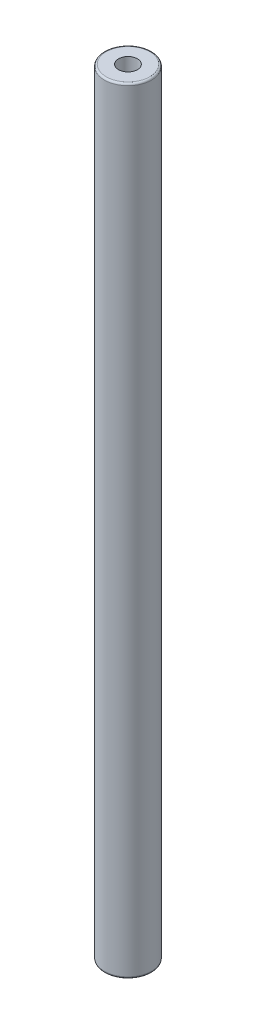
ISO-10303-21;
HEADER;
FILE_DESCRIPTION(('STEP AP214'),'2;1');
FILE_NAME('part.step','',(''),(''),'','','');
FILE_SCHEMA(('AUTOMOTIVE_DESIGN { 1 0 10303 214 1 1 1 1 }'));
ENDSEC;
DATA;
#1=APPLICATION_CONTEXT('core data for automotive mechanical design processes');
#2=APPLICATION_PROTOCOL_DEFINITION('international standard','automotive_design',2000,#1);
#3=PRODUCT_CONTEXT('',#1,'mechanical');
#4=PRODUCT('Part','Part','',(#3));
#5=PRODUCT_RELATED_PRODUCT_CATEGORY('part','',(#4));
#6=PRODUCT_DEFINITION_FORMATION('','',#4);
#7=PRODUCT_DEFINITION_CONTEXT('part definition',#1,'design');
#8=PRODUCT_DEFINITION('design','',#6,#7);
#9=PRODUCT_DEFINITION_SHAPE('','',#8);
#10=(LENGTH_UNIT() NAMED_UNIT(*) SI_UNIT(.MILLI.,.METRE.));
#11=(NAMED_UNIT(*) PLANE_ANGLE_UNIT() SI_UNIT($,.RADIAN.));
#12=(NAMED_UNIT(*) SI_UNIT($,.STERADIAN.) SOLID_ANGLE_UNIT());
#13=UNCERTAINTY_MEASURE_WITH_UNIT(LENGTH_MEASURE(1.E-05),#10,'distance_accuracy_value','');
#14=(GEOMETRIC_REPRESENTATION_CONTEXT(3) GLOBAL_UNCERTAINTY_ASSIGNED_CONTEXT((#13)) GLOBAL_UNIT_ASSIGNED_CONTEXT((#10,
#11,#12)) REPRESENTATION_CONTEXT('',''));
#15=CARTESIAN_POINT('',(0.,0.,0.));
#16=DIRECTION('',(0.,0.,1.));
#17=DIRECTION('',(1.,0.,0.));
#18=AXIS2_PLACEMENT_3D('',#15,#16,#17);
#19=CARTESIAN_POINT('',(0.,-41.,-2.49999999999998));
#20=DIRECTION('',(0.,1.,0.));
#21=DIRECTION('',(0.,0.,1.));
#22=AXIS2_PLACEMENT_3D('',#19,#20,#21);
#23=PLANE('',#22);
#24=CARTESIAN_POINT('',(0.,-41.,0.));
#25=DIRECTION('',(0.,1.,0.));
#26=DIRECTION('',(0.,0.,1.));
#27=AXIS2_PLACEMENT_3D('',#24,#25,#26);
#28=CIRCLE('',#27,2.29999999999998);
#29=CARTESIAN_POINT('',(0.,-41.,2.29999999999998));
#30=VERTEX_POINT('',#29);
#31=EDGE_CURVE('E45',#30,#30,#28,.F.);
#32=ORIENTED_EDGE('',*,*,#31,.T.);
#33=EDGE_LOOP('',(#32));
#34=FACE_BOUND('',#33,.T.);
#35=CARTESIAN_POINT('',(0.,-41.,0.));
#36=DIRECTION('',(0.,1.,0.));
#37=DIRECTION('',(0.,0.,1.));
#38=AXIS2_PLACEMENT_3D('',#35,#36,#37);
#39=CIRCLE('',#38,1.);
#40=CARTESIAN_POINT('',(0.,-41.,1.));
#41=VERTEX_POINT('',#40);
#42=EDGE_CURVE('E61',#41,#41,#39,.T.);
#43=ORIENTED_EDGE('',*,*,#42,.T.);
#44=EDGE_LOOP('',(#43));
#45=FACE_BOUND('',#44,.T.);
#46=ADVANCED_FACE('F37',(#34,#45),#23,.F.);
#47=CARTESIAN_POINT('',(0.,41.,0.));
#48=DIRECTION('',(0.,1.,0.));
#49=DIRECTION('',(0.,0.,1.));
#50=AXIS2_PLACEMENT_3D('',#47,#48,#49);
#51=CYLINDRICAL_SURFACE('',#50,2.49999999999998);
#52=CARTESIAN_POINT('',(0.,-40.8,0.));
#53=DIRECTION('',(0.,1.,0.));
#54=DIRECTION('',(0.,0.,1.));
#55=AXIS2_PLACEMENT_3D('',#52,#53,#54);
#56=CIRCLE('',#55,2.49999999999998);
#57=CARTESIAN_POINT('',(0.,-40.8,2.49999999999998));
#58=VERTEX_POINT('',#57);
#59=EDGE_CURVE('E50',#58,#58,#56,.T.);
#60=ORIENTED_EDGE('',*,*,#59,.T.);
#61=EDGE_LOOP('',(#60));
#62=FACE_BOUND('',#61,.T.);
#63=CARTESIAN_POINT('',(0.,40.8,0.));
#64=DIRECTION('',(0.,-1.,0.));
#65=DIRECTION('',(0.,0.,-1.));
#66=AXIS2_PLACEMENT_3D('',#63,#64,#65);
#67=CIRCLE('',#66,2.49999999999998);
#68=CARTESIAN_POINT('',(0.,40.8,-2.49999999999998));
#69=VERTEX_POINT('',#68);
#70=EDGE_CURVE('E55',#69,#69,#67,.T.);
#71=ORIENTED_EDGE('',*,*,#70,.T.);
#72=EDGE_LOOP('',(#71));
#73=FACE_BOUND('',#72,.T.);
#74=ADVANCED_FACE('F80',(#62,#73),#51,.T.);
#75=CARTESIAN_POINT('',(0.,41.,0.));
#76=DIRECTION('',(0.,-1.,0.));
#77=DIRECTION('',(0.,0.,-1.));
#78=AXIS2_PLACEMENT_3D('',#75,#76,#77);
#79=PLANE('',#78);
#80=CARTESIAN_POINT('',(0.,41.,0.));
#81=DIRECTION('',(0.,-1.,0.));
#82=DIRECTION('',(0.,0.,-1.));
#83=AXIS2_PLACEMENT_3D('',#80,#81,#82);
#84=CIRCLE('',#83,2.29999999999998);
#85=CARTESIAN_POINT('',(0.,41.,-2.29999999999998));
#86=VERTEX_POINT('',#85);
#87=EDGE_CURVE('E10',#86,#86,#84,.F.);
#88=ORIENTED_EDGE('',*,*,#87,.T.);
#89=EDGE_LOOP('',(#88));
#90=FACE_BOUND('',#89,.T.);
#91=CARTESIAN_POINT('',(0.,41.,0.));
#92=DIRECTION('',(0.,1.,0.));
#93=DIRECTION('',(0.,0.,1.));
#94=AXIS2_PLACEMENT_3D('',#91,#92,#93);
#95=CIRCLE('',#94,1.);
#96=CARTESIAN_POINT('',(0.,41.,1.));
#97=VERTEX_POINT('',#96);
#98=EDGE_CURVE('E62',#97,#97,#95,.T.);
#99=ORIENTED_EDGE('',*,*,#98,.F.);
#100=EDGE_LOOP('',(#99));
#101=FACE_BOUND('',#100,.T.);
#102=ADVANCED_FACE('F75',(#90,#101),#79,.F.);
#103=CARTESIAN_POINT('',(0.,-41.,0.));
#104=DIRECTION('',(0.,1.,0.));
#105=DIRECTION('',(0.,0.,1.));
#106=AXIS2_PLACEMENT_3D('',#103,#104,#105);
#107=CYLINDRICAL_SURFACE('',#106,1.);
#108=ORIENTED_EDGE('',*,*,#42,.F.);
#109=EDGE_LOOP('',(#108));
#110=FACE_BOUND('',#109,.T.);
#111=ORIENTED_EDGE('',*,*,#98,.T.);
#112=EDGE_LOOP('',(#111));
#113=FACE_BOUND('',#112,.T.);
#114=ADVANCED_FACE('F71',(#110,#113),#107,.F.);
#115=CARTESIAN_POINT('',(0.,-40.8,0.));
#116=DIRECTION('',(0.,1.,0.));
#117=DIRECTION('',(0.,0.,1.));
#118=AXIS2_PLACEMENT_3D('',#115,#116,#117);
#119=TOROIDAL_SURFACE('',#118,2.29999999999998,0.2);
#120=ORIENTED_EDGE('',*,*,#31,.F.);
#121=EDGE_LOOP('',(#120));
#122=FACE_BOUND('',#121,.T.);
#123=ORIENTED_EDGE('',*,*,#59,.F.);
#124=EDGE_LOOP('',(#123));
#125=FACE_BOUND('',#124,.T.);
#126=ADVANCED_FACE('F74',(#122,#125),#119,.T.);
#127=CARTESIAN_POINT('',(0.,40.8,0.));
#128=DIRECTION('',(0.,-1.,0.));
#129=DIRECTION('',(0.,0.,-1.));
#130=AXIS2_PLACEMENT_3D('',#127,#128,#129);
#131=TOROIDAL_SURFACE('',#130,2.29999999999998,0.2);
#132=ORIENTED_EDGE('',*,*,#70,.F.);
#133=EDGE_LOOP('',(#132));
#134=FACE_BOUND('',#133,.T.);
#135=ORIENTED_EDGE('',*,*,#87,.F.);
#136=EDGE_LOOP('',(#135));
#137=FACE_BOUND('',#136,.T.);
#138=ADVANCED_FACE('F39',(#134,#137),#131,.T.);
#139=CLOSED_SHELL('',(#46,#74,#102,#114,#126,#138));
#140=MANIFOLD_SOLID_BREP('B2',#139);
#141=ADVANCED_BREP_SHAPE_REPRESENTATION('',(#18,#140),#14);
#142=SHAPE_DEFINITION_REPRESENTATION(#9,#141);
ENDSEC;
END-ISO-10303-21;
